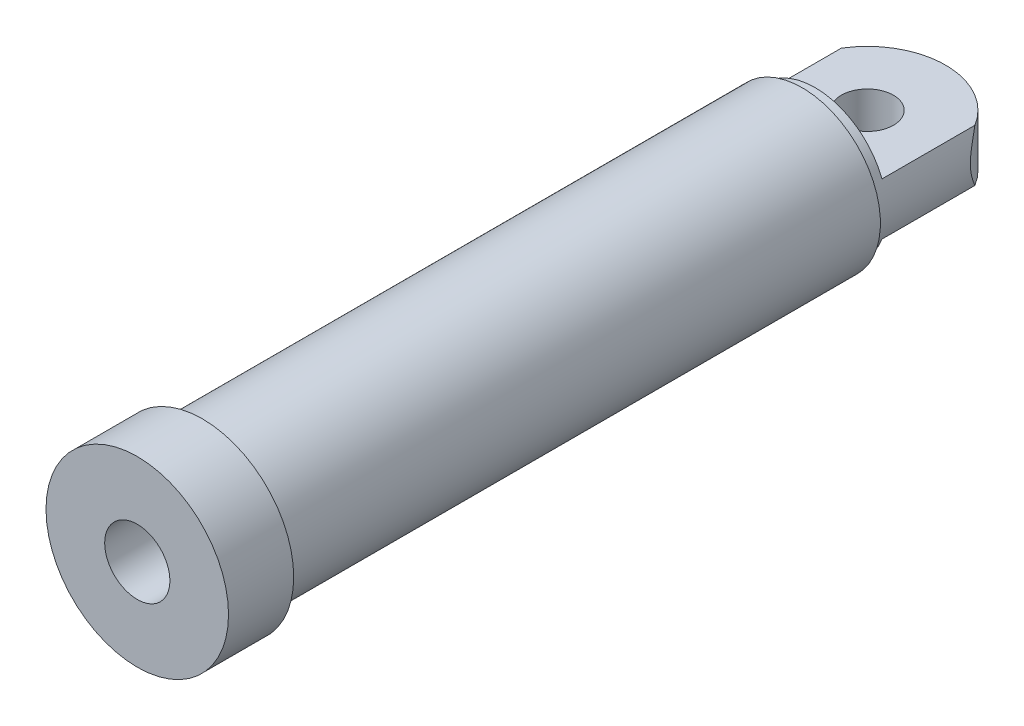
ISO-10303-21;
HEADER;
FILE_DESCRIPTION(('STEP AP214'),'2;1');
FILE_NAME('part.step','',(''),(''),'','','');
FILE_SCHEMA(('AUTOMOTIVE_DESIGN { 1 0 10303 214 1 1 1 1 }'));
ENDSEC;
DATA;
#1=APPLICATION_CONTEXT('core data for automotive mechanical design processes');
#2=APPLICATION_PROTOCOL_DEFINITION('international standard','automotive_design',2000,#1);
#3=PRODUCT_CONTEXT('',#1,'mechanical');
#4=PRODUCT('Part','Part','',(#3));
#5=PRODUCT_RELATED_PRODUCT_CATEGORY('part','',(#4));
#6=PRODUCT_DEFINITION_FORMATION('','',#4);
#7=PRODUCT_DEFINITION_CONTEXT('part definition',#1,'design');
#8=PRODUCT_DEFINITION('design','',#6,#7);
#9=PRODUCT_DEFINITION_SHAPE('','',#8);
#10=(LENGTH_UNIT() NAMED_UNIT(*) SI_UNIT(.MILLI.,.METRE.));
#11=(NAMED_UNIT(*) PLANE_ANGLE_UNIT() SI_UNIT($,.RADIAN.));
#12=(NAMED_UNIT(*) SI_UNIT($,.STERADIAN.) SOLID_ANGLE_UNIT());
#13=UNCERTAINTY_MEASURE_WITH_UNIT(LENGTH_MEASURE(1.E-05),#10,'distance_accuracy_value','');
#14=(GEOMETRIC_REPRESENTATION_CONTEXT(3) GLOBAL_UNCERTAINTY_ASSIGNED_CONTEXT((#13)) GLOBAL_UNIT_ASSIGNED_CONTEXT((#10,
#11,#12)) REPRESENTATION_CONTEXT('',''));
#15=CARTESIAN_POINT('',(0.,0.,0.));
#16=DIRECTION('',(0.,0.,1.));
#17=DIRECTION('',(1.,0.,0.));
#18=AXIS2_PLACEMENT_3D('',#15,#16,#17);
#19=CARTESIAN_POINT('',(0.,0.,0.));
#20=DIRECTION('',(0.,0.,-1.));
#21=DIRECTION('',(-1.,0.,0.));
#22=AXIS2_PLACEMENT_3D('',#19,#20,#21);
#23=CYLINDRICAL_SURFACE('',#22,60.);
#24=CARTESIAN_POINT('',(0.,0.,510.));
#25=DIRECTION('',(0.,0.,-1.));
#26=DIRECTION('',(-1.,0.,0.));
#27=AXIS2_PLACEMENT_3D('',#24,#25,#26);
#28=CIRCLE('',#27,60.);
#29=CARTESIAN_POINT('',(-59.9999999999999,0.,510.));
#30=VERTEX_POINT('',#29);
#31=EDGE_CURVE('E93',#30,#30,#28,.T.);
#32=ORIENTED_EDGE('',*,*,#31,.T.);
#33=EDGE_LOOP('',(#32));
#34=FACE_BOUND('',#33,.T.);
#35=CARTESIAN_POINT('',(0.,0.,50.));
#36=DIRECTION('',(0.,0.,-1.));
#37=DIRECTION('',(-1.,0.,0.));
#38=AXIS2_PLACEMENT_3D('',#35,#36,#37);
#39=CIRCLE('',#38,60.);
#40=CARTESIAN_POINT('',(-60.,0.,50.));
#41=VERTEX_POINT('',#40);
#42=EDGE_CURVE('E40',#41,#41,#39,.T.);
#43=ORIENTED_EDGE('',*,*,#42,.F.);
#44=EDGE_LOOP('',(#43));
#45=FACE_BOUND('',#44,.T.);
#46=ADVANCED_FACE('F37',(#34,#45),#23,.T.);
#47=CARTESIAN_POINT('',(45.0000000000001,0.,60.));
#48=DIRECTION('',(0.,0.,-1.));
#49=DIRECTION('',(-1.,0.,0.));
#50=AXIS2_PLACEMENT_3D('',#47,#48,#49);
#51=PLANE('',#50);
#52=CARTESIAN_POINT('',(0.,0.,60.));
#53=DIRECTION('',(0.,0.,-1.));
#54=DIRECTION('',(-1.,0.,0.));
#55=AXIS2_PLACEMENT_3D('',#52,#53,#54);
#56=CIRCLE('',#55,45.0000000000001);
#57=CARTESIAN_POINT('',(-45.0000000000001,0.,60.));
#58=VERTEX_POINT('',#57);
#59=EDGE_CURVE('E120',#58,#58,#56,.T.);
#60=ORIENTED_EDGE('',*,*,#59,.F.);
#61=EDGE_LOOP('',(#60));
#62=FACE_BOUND('',#61,.T.);
#63=ADVANCED_FACE('F161',(#62),#51,.F.);
#64=CARTESIAN_POINT('',(0.,0.,0.));
#65=DIRECTION('',(0.,0.,-1.));
#66=DIRECTION('',(-1.,0.,0.));
#67=AXIS2_PLACEMENT_3D('',#64,#65,#66);
#68=CYLINDRICAL_SURFACE('',#67,45.);
#69=CARTESIAN_POINT('',(0.,0.,480.));
#70=DIRECTION('',(0.,0.,-1.));
#71=DIRECTION('',(-1.,0.,0.));
#72=AXIS2_PLACEMENT_3D('',#69,#70,#71);
#73=CIRCLE('',#72,45.);
#74=CARTESIAN_POINT('',(-44.9999999999999,0.,480.));
#75=VERTEX_POINT('',#74);
#76=EDGE_CURVE('E117',#75,#75,#73,.T.);
#77=ORIENTED_EDGE('',*,*,#76,.F.);
#78=EDGE_LOOP('',(#77));
#79=FACE_BOUND('',#78,.T.);
#80=ORIENTED_EDGE('',*,*,#59,.T.);
#81=EDGE_LOOP('',(#80));
#82=FACE_BOUND('',#81,.T.);
#83=ADVANCED_FACE('F166',(#79,#82),#68,.F.);
#84=CARTESIAN_POINT('',(25.0000000000001,0.,480.));
#85=DIRECTION('',(0.,0.,1.));
#86=DIRECTION('',(1.,0.,0.));
#87=AXIS2_PLACEMENT_3D('',#84,#85,#86);
#88=PLANE('',#87);
#89=CARTESIAN_POINT('',(0.,0.,480.));
#90=DIRECTION('',(0.,0.,-1.));
#91=DIRECTION('',(-1.,0.,0.));
#92=AXIS2_PLACEMENT_3D('',#89,#90,#91);
#93=CIRCLE('',#92,25.);
#94=CARTESIAN_POINT('',(-24.9999999999999,0.,480.));
#95=VERTEX_POINT('',#94);
#96=EDGE_CURVE('E114',#95,#95,#93,.T.);
#97=ORIENTED_EDGE('',*,*,#96,.F.);
#98=EDGE_LOOP('',(#97));
#99=FACE_BOUND('',#98,.T.);
#100=ORIENTED_EDGE('',*,*,#76,.T.);
#101=EDGE_LOOP('',(#100));
#102=FACE_BOUND('',#101,.T.);
#103=ADVANCED_FACE('F204',(#99,#102),#88,.F.);
#104=CARTESIAN_POINT('',(0.,0.,0.));
#105=DIRECTION('',(0.,0.,-1.));
#106=DIRECTION('',(-1.,0.,0.));
#107=AXIS2_PLACEMENT_3D('',#104,#105,#106);
#108=CYLINDRICAL_SURFACE('',#107,25.);
#109=CARTESIAN_POINT('',(0.,0.,560.));
#110=DIRECTION('',(0.,0.,-1.));
#111=DIRECTION('',(-1.,0.,0.));
#112=AXIS2_PLACEMENT_3D('',#109,#110,#111);
#113=CIRCLE('',#112,25.);
#114=CARTESIAN_POINT('',(-24.9999999999999,0.,560.));
#115=VERTEX_POINT('',#114);
#116=EDGE_CURVE('E111',#115,#115,#113,.T.);
#117=ORIENTED_EDGE('',*,*,#116,.F.);
#118=EDGE_LOOP('',(#117));
#119=FACE_BOUND('',#118,.T.);
#120=ORIENTED_EDGE('',*,*,#96,.T.);
#121=EDGE_LOOP('',(#120));
#122=FACE_BOUND('',#121,.T.);
#123=ADVANCED_FACE('F208',(#119,#122),#108,.F.);
#124=CARTESIAN_POINT('',(70.0000000000001,0.,560.));
#125=DIRECTION('',(0.,0.,-1.));
#126=DIRECTION('',(-1.,0.,0.));
#127=AXIS2_PLACEMENT_3D('',#124,#125,#126);
#128=PLANE('',#127);
#129=CARTESIAN_POINT('',(0.,0.,560.));
#130=DIRECTION('',(0.,0.,-1.));
#131=DIRECTION('',(-1.,0.,0.));
#132=AXIS2_PLACEMENT_3D('',#129,#130,#131);
#133=CIRCLE('',#132,70.);
#134=CARTESIAN_POINT('',(-69.9999999999999,0.,560.));
#135=VERTEX_POINT('',#134);
#136=EDGE_CURVE('E108',#135,#135,#133,.T.);
#137=ORIENTED_EDGE('',*,*,#136,.F.);
#138=EDGE_LOOP('',(#137));
#139=FACE_BOUND('',#138,.T.);
#140=ORIENTED_EDGE('',*,*,#116,.T.);
#141=EDGE_LOOP('',(#140));
#142=FACE_BOUND('',#141,.T.);
#143=ADVANCED_FACE('F212',(#139,#142),#128,.F.);
#144=CARTESIAN_POINT('',(0.,0.,0.));
#145=DIRECTION('',(0.,0.,-1.));
#146=DIRECTION('',(-1.,0.,0.));
#147=AXIS2_PLACEMENT_3D('',#144,#145,#146);
#148=CYLINDRICAL_SURFACE('',#147,70.);
#149=CARTESIAN_POINT('',(0.,0.,510.));
#150=DIRECTION('',(0.,0.,-1.));
#151=DIRECTION('',(-1.,0.,0.));
#152=AXIS2_PLACEMENT_3D('',#149,#150,#151);
#153=CIRCLE('',#152,70.);
#154=CARTESIAN_POINT('',(-69.9999999999999,0.,510.));
#155=VERTEX_POINT('',#154);
#156=EDGE_CURVE('E97',#155,#155,#153,.T.);
#157=ORIENTED_EDGE('',*,*,#156,.F.);
#158=EDGE_LOOP('',(#157));
#159=FACE_BOUND('',#158,.T.);
#160=ORIENTED_EDGE('',*,*,#136,.T.);
#161=EDGE_LOOP('',(#160));
#162=FACE_BOUND('',#161,.T.);
#163=ADVANCED_FACE('F216',(#159,#162),#148,.T.);
#164=CARTESIAN_POINT('',(70.0000000000001,0.,510.));
#165=DIRECTION('',(0.,0.,1.));
#166=DIRECTION('',(1.,0.,0.));
#167=AXIS2_PLACEMENT_3D('',#164,#165,#166);
#168=PLANE('',#167);
#169=ORIENTED_EDGE('',*,*,#31,.F.);
#170=EDGE_LOOP('',(#169));
#171=FACE_BOUND('',#170,.T.);
#172=ORIENTED_EDGE('',*,*,#156,.T.);
#173=EDGE_LOOP('',(#172));
#174=FACE_BOUND('',#173,.T.);
#175=ADVANCED_FACE('F144',(#171,#174),#168,.F.);
#176=CARTESIAN_POINT('',(0.,0.,50.));
#177=DIRECTION('',(0.,0.,-1.));
#178=DIRECTION('',(-1.,0.,0.));
#179=AXIS2_PLACEMENT_3D('',#176,#177,#178);
#180=PLANE('',#179);
#181=CARTESIAN_POINT('',(0.,0.,50.));
#182=DIRECTION('',(0.,0.,-1.));
#183=DIRECTION('',(-1.,0.,0.));
#184=AXIS2_PLACEMENT_3D('',#181,#182,#183);
#185=CIRCLE('',#184,55.);
#186=CARTESIAN_POINT('',(-55.,0.,50.));
#187=VERTEX_POINT('',#186);
#188=EDGE_CURVE('E188',#187,#187,#185,.T.);
#189=ORIENTED_EDGE('',*,*,#188,.F.);
#190=EDGE_LOOP('',(#189));
#191=FACE_BOUND('',#190,.T.);
#192=ORIENTED_EDGE('',*,*,#42,.T.);
#193=EDGE_LOOP('',(#192));
#194=FACE_BOUND('',#193,.T.);
#195=ADVANCED_FACE('F139',(#191,#194),#180,.T.);
#196=CARTESIAN_POINT('',(0.,0.,50.));
#197=DIRECTION('',(0.,0.,-1.));
#198=DIRECTION('',(-1.,0.,0.));
#199=AXIS2_PLACEMENT_3D('',#196,#197,#198);
#200=CYLINDRICAL_SURFACE('',#199,55.);
#201=ORIENTED_EDGE('',*,*,#188,.T.);
#202=EDGE_LOOP('',(#201));
#203=FACE_BOUND('',#202,.T.);
#204=CARTESIAN_POINT('',(-51.234753829798,20.,-31.2249899919919));
#205=CARTESIAN_POINT('',(-51.3712103418228,19.6504237364978,-31.0010938328795));
#206=CARTESIAN_POINT('',(-51.5045010722681,19.2984175196761,-30.7790780288577));
#207=CARTESIAN_POINT('',(-51.7646776284598,18.5892682173008,-30.3394685057058));
#208=CARTESIAN_POINT('',(-51.8915628826439,18.2321246769833,-30.1218751822258));
#209=CARTESIAN_POINT('',(-52.2627851917116,17.1517340394822,-29.4762232921029));
#210=CARTESIAN_POINT('',(-52.4973346402981,16.4204317204274,-29.0558766833022));
#211=CARTESIAN_POINT('',(-52.9438002271502,14.9191174032238,-28.2343246571702));
#212=CARTESIAN_POINT('',(-53.1551453959298,14.148616962826,-27.8336977894913));
#213=CARTESIAN_POINT('',(-53.5476985578258,12.5815736915443,-27.0707928493247));
#214=CARTESIAN_POINT('',(-53.7289198957763,11.7850425803651,-26.7084978218561));
#215=CARTESIAN_POINT('',(-54.0320486449519,10.2964403032531,-26.0890146093488));
#216=CARTESIAN_POINT('',(-54.1588093516962,9.60850208399527,-25.824319564569));
#217=CARTESIAN_POINT('',(-54.3878807602413,8.21328418298736,-25.3383236994417));
#218=CARTESIAN_POINT('',(-54.4901915331757,7.50600455751513,-25.1170227528453));
#219=CARTESIAN_POINT('',(-54.6676594152826,6.079414602545,-24.728373986342));
#220=CARTESIAN_POINT('',(-54.7430277551137,5.36024628748654,-24.560607619583));
#221=CARTESIAN_POINT('',(-54.8658161359943,3.90805134142374,-24.2850814531454));
#222=CARTESIAN_POINT('',(-54.9132396611083,3.17502644977659,-24.1773141730769));
#223=CARTESIAN_POINT('',(-54.9790922993348,1.69071815352413,-24.0272020410826));
#224=CARTESIAN_POINT('',(-54.9971160006449,0.939322146177825,-23.9857720949582));
#225=CARTESIAN_POINT('',(-55.0022441114968,-0.564122307132695,-23.974010795699));
#226=CARTESIAN_POINT('',(-54.9893491524318,-1.31617073946016,-24.0036779906824));
#227=CARTESIAN_POINT('',(-54.933030345018,-2.81547449110806,-24.1322803420913));
#228=CARTESIAN_POINT('',(-54.8895092852759,-3.56270688150815,-24.2314360603559));
#229=CARTESIAN_POINT('',(-54.7732967602278,-5.04362627676651,-24.4929825623701));
#230=CARTESIAN_POINT('',(-54.7005991865704,-5.7773104115164,-24.6553865874797));
#231=CARTESIAN_POINT('',(-54.5055023316134,-7.41600648368185,-25.0842378146332));
#232=CARTESIAN_POINT('',(-54.3750869446152,-8.31582405094968,-25.366770913127));
#233=CARTESIAN_POINT('',(-54.0750770237305,-10.0842285671677,-26.0001633436826));
#234=CARTESIAN_POINT('',(-53.905463062673,-10.9527997826453,-26.3510565420488));
#235=CARTESIAN_POINT('',(-53.5300769735132,-12.6608560434831,-27.1055121659923));
#236=CARTESIAN_POINT('',(-53.3242218928405,-13.5002689540104,-27.5091948645809));
#237=CARTESIAN_POINT('',(-52.8792385885377,-15.1497743587683,-28.3551495939166));
#238=CARTESIAN_POINT('',(-52.6401204697679,-15.9598756636414,-28.7974098901525));
#239=CARTESIAN_POINT('',(-52.207951260875,-17.3109334351971,-29.5713066295323));
#240=CARTESIAN_POINT('',(-52.0230363606781,-17.8587485796701,-29.8956334935264));
#241=CARTESIAN_POINT('',(-51.639340122877,-18.9395084157563,-30.5536154642438));
#242=CARTESIAN_POINT('',(-51.4406371557238,-19.4725163514551,-30.8872122757043));
#243=CARTESIAN_POINT('',(-51.234753829798,-20.,-31.2249899919919));
#244=B_SPLINE_CURVE_WITH_KNOTS('',3,(#204,#205,#206,#207,#208,#209,#210,#211,#212,#213,#214,
#215,#216,#217,#218,#219,#220,#221,#222,#223,#224,#225,#226,#227,#228,#229,#230,#231,#232,#233,
#234,#235,#236,#237,#238,#239,#240,#241,#242,#243),.UNSPECIFIED.,.F.,.F.,(4,2,2,2,2,2,2,2,2,2,2,
2,2,2,2,2,2,2,2,4),(0.,1.31090200495055,2.62192077599482,5.24735611740963,7.92729682701593,
10.6060471425754,12.84821496436,15.0903762627869,17.3145520049003,19.5384503856338,
21.7927638622824,24.0470313037586,26.3084865603976,28.570415519115,31.4219764528141,
34.2749536884494,37.1345481013978,39.9932756977515,41.981735899764,43.9596969653085),.UNSPECIFIED.);
#245=CARTESIAN_POINT('',(-51.234753829798,20.,-31.2249899919919));
#246=VERTEX_POINT('',#245);
#247=CARTESIAN_POINT('',(-51.234753829798,-20.,-31.2249899919919));
#248=VERTEX_POINT('',#247);
#249=EDGE_CURVE('E11',#246,#248,#244,.T.);
#250=ORIENTED_EDGE('',*,*,#249,.T.);
#251=DIRECTION('',(0.,0.,-1.));
#252=VECTOR('',#251,1.);
#253=CARTESIAN_POINT('',(-51.234753829798,-20.,50.));
#254=LINE('',#253,#252);
#255=CARTESIAN_POINT('',(-51.234753829798,-20.,40.));
#256=VERTEX_POINT('',#255);
#257=EDGE_CURVE('E175',#248,#256,#254,.F.);
#258=ORIENTED_EDGE('',*,*,#257,.T.);
#259=CARTESIAN_POINT('',(0.,0.,40.));
#260=DIRECTION('',(0.,0.,1.));
#261=DIRECTION('',(1.,0.,0.));
#262=AXIS2_PLACEMENT_3D('',#259,#260,#261);
#263=CIRCLE('',#262,55.);
#264=CARTESIAN_POINT('',(51.234753829798,-20.,40.));
#265=VERTEX_POINT('',#264);
#266=EDGE_CURVE('E90',#256,#265,#263,.T.);
#267=ORIENTED_EDGE('',*,*,#266,.T.);
#268=DIRECTION('',(0.,0.,-1.));
#269=VECTOR('',#268,1.);
#270=CARTESIAN_POINT('',(51.234753829798,-20.,50.));
#271=LINE('',#270,#269);
#272=CARTESIAN_POINT('',(51.234753829798,-20.,-31.224989991992));
#273=VERTEX_POINT('',#272);
#274=EDGE_CURVE('E52',#265,#273,#271,.T.);
#275=ORIENTED_EDGE('',*,*,#274,.T.);
#276=CARTESIAN_POINT('',(51.234753829798,-20.,-31.224989991992));
#277=CARTESIAN_POINT('',(51.3712103418227,-19.6504237364978,-31.0010938328795));
#278=CARTESIAN_POINT('',(51.5045010722681,-19.2984175196761,-30.7790780288578));
#279=CARTESIAN_POINT('',(51.7646776284598,-18.5892682173008,-30.3394685057058));
#280=CARTESIAN_POINT('',(51.8915628826439,-18.2321246769833,-30.1218751822258));
#281=CARTESIAN_POINT('',(52.2627851917116,-17.1517340394822,-29.4762232921029));
#282=CARTESIAN_POINT('',(52.4973346402981,-16.4204317204274,-29.0558766833022));
#283=CARTESIAN_POINT('',(52.9438002271502,-14.9191174032238,-28.2343246571702));
#284=CARTESIAN_POINT('',(53.1551453959298,-14.148616962826,-27.8336977894913));
#285=CARTESIAN_POINT('',(53.5476985578258,-12.5815736915443,-27.0707928493247));
#286=CARTESIAN_POINT('',(53.7289198957763,-11.7850425803651,-26.7084978218561));
#287=CARTESIAN_POINT('',(54.0320486449519,-10.2964403032531,-26.0890146093488));
#288=CARTESIAN_POINT('',(54.1588093516962,-9.60850208399527,-25.824319564569));
#289=CARTESIAN_POINT('',(54.3878807602413,-8.21328418298737,-25.3383236994417));
#290=CARTESIAN_POINT('',(54.4901915331757,-7.50600455751514,-25.1170227528453));
#291=CARTESIAN_POINT('',(54.6676594152826,-6.07941460254501,-24.728373986342));
#292=CARTESIAN_POINT('',(54.7430277551137,-5.36024628748655,-24.560607619583));
#293=CARTESIAN_POINT('',(54.8658161359943,-3.90805134142375,-24.2850814531454));
#294=CARTESIAN_POINT('',(54.9132396611083,-3.1750264497766,-24.1773141730769));
#295=CARTESIAN_POINT('',(54.9790922993348,-1.69071815352414,-24.0272020410826));
#296=CARTESIAN_POINT('',(54.9971160006449,-0.939322146177828,-23.9857720949582));
#297=CARTESIAN_POINT('',(55.0022441114968,0.564122307132693,-23.974010795699));
#298=CARTESIAN_POINT('',(54.9893491524318,1.31617073946016,-24.0036779906824));
#299=CARTESIAN_POINT('',(54.933030345018,2.81547449110805,-24.1322803420913));
#300=CARTESIAN_POINT('',(54.8895092852759,3.56270688150814,-24.2314360603559));
#301=CARTESIAN_POINT('',(54.7732967602278,5.0436262767665,-24.4929825623701));
#302=CARTESIAN_POINT('',(54.7005991865704,5.7773104115164,-24.6553865874797));
#303=CARTESIAN_POINT('',(54.5055023316134,7.41600648368185,-25.0842378146331));
#304=CARTESIAN_POINT('',(54.3750869446152,8.31582405094967,-25.366770913127));
#305=CARTESIAN_POINT('',(54.0750770237305,10.0842285671677,-26.0001633436826));
#306=CARTESIAN_POINT('',(53.905463062673,10.9527997826453,-26.3510565420488));
#307=CARTESIAN_POINT('',(53.5300769735132,12.6608560434831,-27.1055121659923));
#308=CARTESIAN_POINT('',(53.3242218928405,13.5002689540104,-27.5091948645809));
#309=CARTESIAN_POINT('',(52.8792385885377,15.1497743587683,-28.3551495939166));
#310=CARTESIAN_POINT('',(52.6401204697679,15.9598756636414,-28.7974098901525));
#311=CARTESIAN_POINT('',(52.207951260875,17.3109334351971,-29.5713066295323));
#312=CARTESIAN_POINT('',(52.0230363606781,17.8587485796701,-29.8956334935264));
#313=CARTESIAN_POINT('',(51.639340122877,18.9395084157563,-30.5536154642438));
#314=CARTESIAN_POINT('',(51.4406371557238,19.4725163514551,-30.8872122757043));
#315=CARTESIAN_POINT('',(51.234753829798,20.,-31.2249899919919));
#316=B_SPLINE_CURVE_WITH_KNOTS('',3,(#276,#277,#278,#279,#280,#281,#282,#283,#284,#285,#286,
#287,#288,#289,#290,#291,#292,#293,#294,#295,#296,#297,#298,#299,#300,#301,#302,#303,#304,#305,
#306,#307,#308,#309,#310,#311,#312,#313,#314,#315),.UNSPECIFIED.,.F.,.F.,(4,2,2,2,2,2,2,2,2,2,2,
2,2,2,2,2,2,2,2,4),(0.,1.31090200495055,2.62192077599482,5.24735611740963,7.92729682701594,
10.6060471425754,12.84821496436,15.0903762627869,17.3145520049003,19.5384503856338,
21.7927638622824,24.0470313037586,26.3084865603976,28.570415519115,31.4219764528141,
34.2749536884494,37.1345481013978,39.9932756977515,41.9817358997641,43.9596969653085),.UNSPECIFIED.);
#317=CARTESIAN_POINT('',(51.234753829798,20.,-31.224989991992));
#318=VERTEX_POINT('',#317);
#319=EDGE_CURVE('E45',#273,#318,#316,.T.);
#320=ORIENTED_EDGE('',*,*,#319,.T.);
#321=DIRECTION('',(0.,0.,-1.));
#322=VECTOR('',#321,1.);
#323=CARTESIAN_POINT('',(51.234753829798,20.,50.));
#324=LINE('',#323,#322);
#325=CARTESIAN_POINT('',(51.234753829798,20.,40.));
#326=VERTEX_POINT('',#325);
#327=EDGE_CURVE('E75',#326,#318,#324,.T.);
#328=ORIENTED_EDGE('',*,*,#327,.F.);
#329=CARTESIAN_POINT('',(0.,0.,40.));
#330=DIRECTION('',(0.,0.,1.));
#331=DIRECTION('',(1.,0.,0.));
#332=AXIS2_PLACEMENT_3D('',#329,#330,#331);
#333=CIRCLE('',#332,55.);
#334=CARTESIAN_POINT('',(-51.234753829798,20.,40.));
#335=VERTEX_POINT('',#334);
#336=EDGE_CURVE('E177',#326,#335,#333,.T.);
#337=ORIENTED_EDGE('',*,*,#336,.T.);
#338=DIRECTION('',(0.,0.,-1.));
#339=VECTOR('',#338,1.);
#340=CARTESIAN_POINT('',(-51.234753829798,20.,50.));
#341=LINE('',#340,#339);
#342=EDGE_CURVE('E58',#246,#335,#341,.F.);
#343=ORIENTED_EDGE('',*,*,#342,.F.);
#344=EDGE_LOOP('',(#250,#258,#267,#275,#320,#328,#337,#343));
#345=FACE_BOUND('',#344,.T.);
#346=ADVANCED_FACE('F74',(#203,#345),#200,.T.);
#347=CARTESIAN_POINT('',(0.,20.,0.));
#348=DIRECTION('',(0.,-1.,0.));
#349=DIRECTION('',(0.,0.,-1.));
#350=AXIS2_PLACEMENT_3D('',#347,#348,#349);
#351=CYLINDRICAL_SURFACE('',#350,20.);
#352=CARTESIAN_POINT('',(0.,20.,0.));
#353=DIRECTION('',(0.,1.,0.));
#354=DIRECTION('',(0.,0.,1.));
#355=AXIS2_PLACEMENT_3D('',#352,#353,#354);
#356=CIRCLE('',#355,20.);
#357=CARTESIAN_POINT('',(0.,20.,20.));
#358=VERTEX_POINT('',#357);
#359=EDGE_CURVE('E99',#358,#358,#356,.T.);
#360=ORIENTED_EDGE('',*,*,#359,.T.);
#361=EDGE_LOOP('',(#360));
#362=FACE_BOUND('',#361,.T.);
#363=CARTESIAN_POINT('',(0.,-20.,0.));
#364=DIRECTION('',(0.,1.,0.));
#365=DIRECTION('',(0.,0.,1.));
#366=AXIS2_PLACEMENT_3D('',#363,#364,#365);
#367=CIRCLE('',#366,20.);
#368=CARTESIAN_POINT('',(0.,-20.,20.));
#369=VERTEX_POINT('',#368);
#370=EDGE_CURVE('E174',#369,#369,#367,.T.);
#371=ORIENTED_EDGE('',*,*,#370,.F.);
#372=EDGE_LOOP('',(#371));
#373=FACE_BOUND('',#372,.T.);
#374=ADVANCED_FACE('F138',(#362,#373),#351,.F.);
#375=CARTESIAN_POINT('',(0.,20.,0.));
#376=DIRECTION('',(0.,-1.,0.));
#377=DIRECTION('',(0.,0.,-1.));
#378=AXIS2_PLACEMENT_3D('',#375,#376,#377);
#379=CYLINDRICAL_SURFACE('',#378,60.);
#380=ORIENTED_EDGE('',*,*,#249,.F.);
#381=CARTESIAN_POINT('',(0.,20.,0.));
#382=DIRECTION('',(0.,1.,0.));
#383=DIRECTION('',(0.,0.,1.));
#384=AXIS2_PLACEMENT_3D('',#381,#382,#383);
#385=CIRCLE('',#384,60.);
#386=EDGE_CURVE('E87',#318,#246,#385,.T.);
#387=ORIENTED_EDGE('',*,*,#386,.F.);
#388=ORIENTED_EDGE('',*,*,#319,.F.);
#389=CARTESIAN_POINT('',(0.,-20.,0.));
#390=DIRECTION('',(0.,1.,0.));
#391=DIRECTION('',(0.,0.,1.));
#392=AXIS2_PLACEMENT_3D('',#389,#390,#391);
#393=CIRCLE('',#392,60.);
#394=EDGE_CURVE('E94',#273,#248,#393,.T.);
#395=ORIENTED_EDGE('',*,*,#394,.T.);
#396=EDGE_LOOP('',(#380,#387,#388,#395));
#397=FACE_BOUND('',#396,.T.);
#398=ADVANCED_FACE('F92',(#397),#379,.T.);
#399=CARTESIAN_POINT('',(0.,-20.,0.));
#400=DIRECTION('',(0.,1.,0.));
#401=DIRECTION('',(0.,0.,1.));
#402=AXIS2_PLACEMENT_3D('',#399,#400,#401);
#403=PLANE('',#402);
#404=ORIENTED_EDGE('',*,*,#370,.T.);
#405=EDGE_LOOP('',(#404));
#406=FACE_BOUND('',#405,.T.);
#407=ORIENTED_EDGE('',*,*,#274,.F.);
#408=DIRECTION('',(1.,0.,0.));
#409=VECTOR('',#408,1.);
#410=CARTESIAN_POINT('',(60.0000000000001,-20.,40.));
#411=LINE('',#410,#409);
#412=EDGE_CURVE('E81',#256,#265,#411,.T.);
#413=ORIENTED_EDGE('',*,*,#412,.F.);
#414=ORIENTED_EDGE('',*,*,#257,.F.);
#415=ORIENTED_EDGE('',*,*,#394,.F.);
#416=EDGE_LOOP('',(#407,#413,#414,#415));
#417=FACE_BOUND('',#416,.T.);
#418=ADVANCED_FACE('F151',(#406,#417),#403,.F.);
#419=CARTESIAN_POINT('',(0.,20.,0.));
#420=DIRECTION('',(0.,1.,0.));
#421=DIRECTION('',(0.,0.,1.));
#422=AXIS2_PLACEMENT_3D('',#419,#420,#421);
#423=PLANE('',#422);
#424=ORIENTED_EDGE('',*,*,#359,.F.);
#425=EDGE_LOOP('',(#424));
#426=FACE_BOUND('',#425,.T.);
#427=DIRECTION('',(1.,0.,0.));
#428=VECTOR('',#427,1.);
#429=CARTESIAN_POINT('',(60.0000000000001,20.,40.));
#430=LINE('',#429,#428);
#431=EDGE_CURVE('E89',#335,#326,#430,.T.);
#432=ORIENTED_EDGE('',*,*,#431,.T.);
#433=ORIENTED_EDGE('',*,*,#327,.T.);
#434=ORIENTED_EDGE('',*,*,#386,.T.);
#435=ORIENTED_EDGE('',*,*,#342,.T.);
#436=EDGE_LOOP('',(#432,#433,#434,#435));
#437=FACE_BOUND('',#436,.T.);
#438=ADVANCED_FACE('F86',(#426,#437),#423,.T.);
#439=CARTESIAN_POINT('',(60.0000000000001,0.,40.));
#440=DIRECTION('',(0.,0.,1.));
#441=DIRECTION('',(1.,0.,0.));
#442=AXIS2_PLACEMENT_3D('',#439,#440,#441);
#443=PLANE('',#442);
#444=ORIENTED_EDGE('',*,*,#266,.F.);
#445=ORIENTED_EDGE('',*,*,#412,.T.);
#446=EDGE_LOOP('',(#444,#445));
#447=FACE_BOUND('',#446,.T.);
#448=ADVANCED_FACE('F150',(#447),#443,.F.);
#449=ORIENTED_EDGE('',*,*,#336,.F.);
#450=ORIENTED_EDGE('',*,*,#431,.F.);
#451=EDGE_LOOP('',(#449,#450));
#452=FACE_BOUND('',#451,.T.);
#453=ADVANCED_FACE('F196',(#452),#443,.F.);
#454=CLOSED_SHELL('',(#46,#63,#83,#103,#123,#143,#163,#175,#195,#346,#374,#398,#418,#438,#448,#453));
#455=MANIFOLD_SOLID_BREP('B2',#454);
#456=ADVANCED_BREP_SHAPE_REPRESENTATION('',(#18,#455),#14);
#457=SHAPE_DEFINITION_REPRESENTATION(#9,#456);
ENDSEC;
END-ISO-10303-21;
